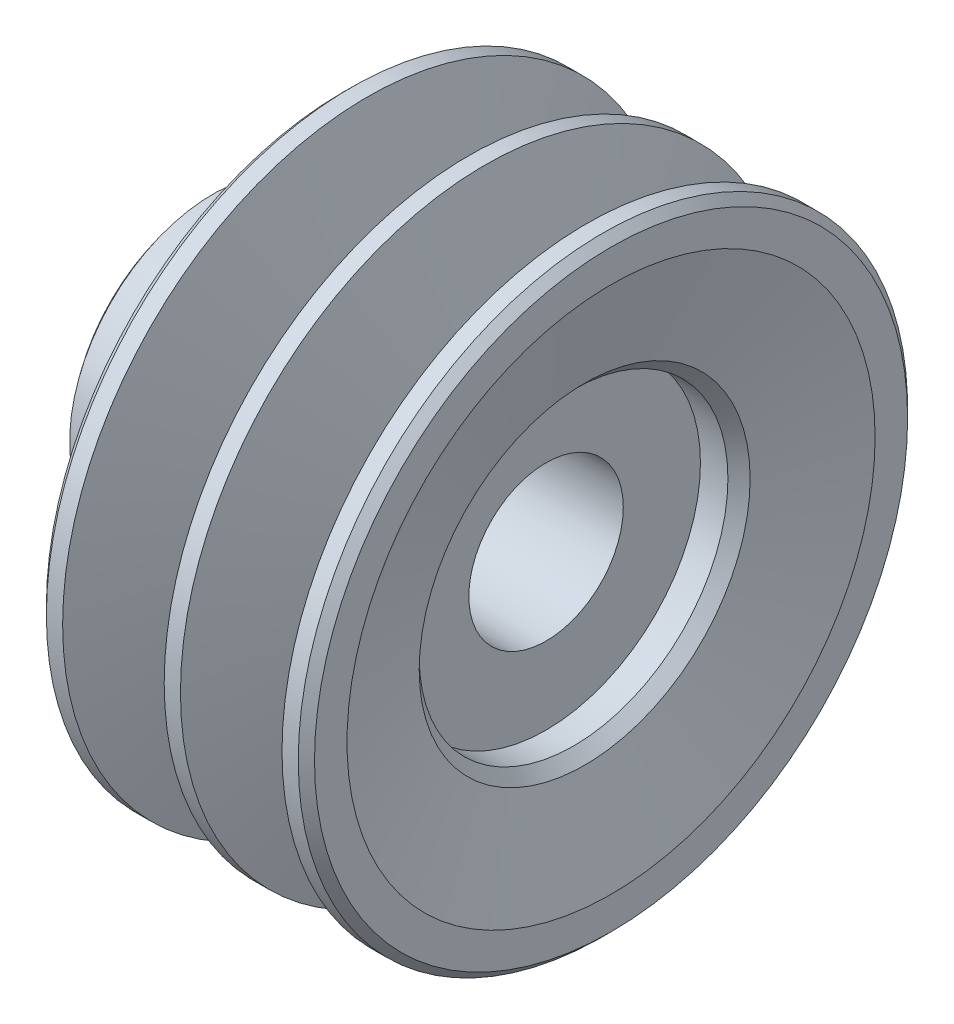
ISO-10303-21;
HEADER;
FILE_DESCRIPTION(('STEP AP214'),'2;1');
FILE_NAME('part.step','',(''),(''),'','','');
FILE_SCHEMA(('AUTOMOTIVE_DESIGN { 1 0 10303 214 1 1 1 1 }'));
ENDSEC;
DATA;
#1=APPLICATION_CONTEXT('core data for automotive mechanical design processes');
#2=APPLICATION_PROTOCOL_DEFINITION('international standard','automotive_design',2000,#1);
#3=PRODUCT_CONTEXT('',#1,'mechanical');
#4=PRODUCT('Part','Part','',(#3));
#5=PRODUCT_RELATED_PRODUCT_CATEGORY('part','',(#4));
#6=PRODUCT_DEFINITION_FORMATION('','',#4);
#7=PRODUCT_DEFINITION_CONTEXT('part definition',#1,'design');
#8=PRODUCT_DEFINITION('design','',#6,#7);
#9=PRODUCT_DEFINITION_SHAPE('','',#8);
#10=(LENGTH_UNIT() NAMED_UNIT(*) SI_UNIT(.MILLI.,.METRE.));
#11=(NAMED_UNIT(*) PLANE_ANGLE_UNIT() SI_UNIT($,.RADIAN.));
#12=(NAMED_UNIT(*) SI_UNIT($,.STERADIAN.) SOLID_ANGLE_UNIT());
#13=UNCERTAINTY_MEASURE_WITH_UNIT(LENGTH_MEASURE(1.E-05),#10,'distance_accuracy_value','');
#14=(GEOMETRIC_REPRESENTATION_CONTEXT(3) GLOBAL_UNCERTAINTY_ASSIGNED_CONTEXT((#13)) GLOBAL_UNIT_ASSIGNED_CONTEXT((#10,
#11,#12)) REPRESENTATION_CONTEXT('',''));
#15=CARTESIAN_POINT('',(0.,0.,0.));
#16=DIRECTION('',(0.,0.,1.));
#17=DIRECTION('',(1.,0.,0.));
#18=AXIS2_PLACEMENT_3D('',#15,#16,#17);
#19=CARTESIAN_POINT('',(18.25,0.,0.));
#20=DIRECTION('',(-1.,0.,0.));
#21=DIRECTION('',(0.,0.,1.));
#22=AXIS2_PLACEMENT_3D('',#19,#20,#21);
#23=CYLINDRICAL_SURFACE('',#22,23.5);
#24=CARTESIAN_POINT('',(18.25,0.,0.));
#25=DIRECTION('',(1.,0.,0.));
#26=DIRECTION('',(0.,0.,-1.));
#27=AXIS2_PLACEMENT_3D('',#24,#25,#26);
#28=CIRCLE('',#27,23.5);
#29=CARTESIAN_POINT('',(18.25,0.,-23.5));
#30=VERTEX_POINT('',#29);
#31=EDGE_CURVE('E125',#30,#30,#28,.F.);
#32=ORIENTED_EDGE('',*,*,#31,.T.);
#33=EDGE_LOOP('',(#32));
#34=FACE_BOUND('',#33,.T.);
#35=CARTESIAN_POINT('',(13.25,0.,0.));
#36=DIRECTION('',(-1.,0.,0.));
#37=DIRECTION('',(0.,0.,1.));
#38=AXIS2_PLACEMENT_3D('',#35,#36,#37);
#39=CIRCLE('',#38,23.5);
#40=CARTESIAN_POINT('',(13.25,0.,23.5));
#41=VERTEX_POINT('',#40);
#42=EDGE_CURVE('E32',#41,#41,#39,.F.);
#43=ORIENTED_EDGE('',*,*,#42,.T.);
#44=EDGE_LOOP('',(#43));
#45=FACE_BOUND('',#44,.T.);
#46=ADVANCED_FACE('F15',(#34,#45),#23,.T.);
#47=CARTESIAN_POINT('',(13.25,0.,0.));
#48=DIRECTION('',(-1.,0.,0.));
#49=DIRECTION('',(0.,-1.,0.));
#50=AXIS2_PLACEMENT_3D('',#47,#48,#49);
#51=CONICAL_SURFACE('',#50,23.5,1.30908282439369);
#52=ORIENTED_EDGE('',*,*,#42,.F.);
#53=EDGE_LOOP('',(#52));
#54=FACE_BOUND('',#53,.T.);
#55=CARTESIAN_POINT('',(9.5,0.,0.));
#56=DIRECTION('',(-1.,0.,0.));
#57=DIRECTION('',(0.,0.,1.));
#58=AXIS2_PLACEMENT_3D('',#55,#56,#57);
#59=CIRCLE('',#58,37.5);
#60=CARTESIAN_POINT('',(9.5,0.,37.5));
#61=VERTEX_POINT('',#60);
#62=EDGE_CURVE('E123',#61,#61,#59,.F.);
#63=ORIENTED_EDGE('',*,*,#62,.T.);
#64=EDGE_LOOP('',(#63));
#65=FACE_BOUND('',#64,.T.);
#66=ADVANCED_FACE('F133',(#54,#65),#51,.T.);
#67=CARTESIAN_POINT('',(18.25,0.,0.));
#68=DIRECTION('',(1.,0.,0.));
#69=DIRECTION('',(0.,0.,-1.));
#70=AXIS2_PLACEMENT_3D('',#67,#68,#69);
#71=CONICAL_SURFACE('',#70,23.5,1.30908282439369);
#72=ORIENTED_EDGE('',*,*,#31,.F.);
#73=EDGE_LOOP('',(#72));
#74=FACE_BOUND('',#73,.T.);
#75=CARTESIAN_POINT('',(22.,0.,0.));
#76=DIRECTION('',(-1.,0.,0.));
#77=DIRECTION('',(0.,0.,1.));
#78=AXIS2_PLACEMENT_3D('',#75,#76,#77);
#79=CIRCLE('',#78,37.5);
#80=CARTESIAN_POINT('',(22.,0.,37.5));
#81=VERTEX_POINT('',#80);
#82=EDGE_CURVE('E120',#81,#81,#79,.T.);
#83=ORIENTED_EDGE('',*,*,#82,.T.);
#84=EDGE_LOOP('',(#83));
#85=FACE_BOUND('',#84,.T.);
#86=ADVANCED_FACE('F136',(#74,#85),#71,.T.);
#87=CARTESIAN_POINT('',(9.5,0.,0.));
#88=DIRECTION('',(-1.,0.,0.));
#89=DIRECTION('',(0.,0.,1.));
#90=AXIS2_PLACEMENT_3D('',#87,#88,#89);
#91=CYLINDRICAL_SURFACE('',#90,37.5);
#92=ORIENTED_EDGE('',*,*,#62,.F.);
#93=EDGE_LOOP('',(#92));
#94=FACE_BOUND('',#93,.T.);
#95=CARTESIAN_POINT('',(7.49999999999995,0.,0.));
#96=DIRECTION('',(1.,0.,0.));
#97=DIRECTION('',(0.,0.,-1.));
#98=AXIS2_PLACEMENT_3D('',#95,#96,#97);
#99=CIRCLE('',#98,37.5);
#100=CARTESIAN_POINT('',(7.5,0.,-37.5));
#101=VERTEX_POINT('',#100);
#102=EDGE_CURVE('E117',#101,#101,#99,.T.);
#103=ORIENTED_EDGE('',*,*,#102,.T.);
#104=EDGE_LOOP('',(#103));
#105=FACE_BOUND('',#104,.T.);
#106=ADVANCED_FACE('F140',(#94,#105),#91,.T.);
#107=CARTESIAN_POINT('',(24.,0.,0.));
#108=DIRECTION('',(-1.,0.,0.));
#109=DIRECTION('',(0.,0.,1.));
#110=AXIS2_PLACEMENT_3D('',#107,#108,#109);
#111=CYLINDRICAL_SURFACE('',#110,37.5);
#112=CARTESIAN_POINT('',(24.,0.,0.));
#113=DIRECTION('',(-1.,0.,0.));
#114=DIRECTION('',(0.,0.,1.));
#115=AXIS2_PLACEMENT_3D('',#112,#113,#114);
#116=CIRCLE('',#115,37.5);
#117=CARTESIAN_POINT('',(24.,0.,37.5));
#118=VERTEX_POINT('',#117);
#119=EDGE_CURVE('E114',#118,#118,#116,.T.);
#120=ORIENTED_EDGE('',*,*,#119,.T.);
#121=EDGE_LOOP('',(#120));
#122=FACE_BOUND('',#121,.T.);
#123=ORIENTED_EDGE('',*,*,#82,.F.);
#124=EDGE_LOOP('',(#123));
#125=FACE_BOUND('',#124,.T.);
#126=ADVANCED_FACE('F143',(#122,#125),#111,.T.);
#127=CARTESIAN_POINT('',(3.75,0.,0.));
#128=DIRECTION('',(1.,0.,0.));
#129=DIRECTION('',(0.,1.,0.));
#130=AXIS2_PLACEMENT_3D('',#127,#128,#129);
#131=CONICAL_SURFACE('',#130,23.5,1.30908282439369);
#132=CARTESIAN_POINT('',(3.75,0.,0.));
#133=DIRECTION('',(-1.,0.,0.));
#134=DIRECTION('',(0.,0.,1.));
#135=AXIS2_PLACEMENT_3D('',#132,#133,#134);
#136=CIRCLE('',#135,23.5);
#137=CARTESIAN_POINT('',(3.75,0.,23.5));
#138=VERTEX_POINT('',#137);
#139=EDGE_CURVE('E109',#138,#138,#136,.F.);
#140=ORIENTED_EDGE('',*,*,#139,.T.);
#141=EDGE_LOOP('',(#140));
#142=FACE_BOUND('',#141,.T.);
#143=ORIENTED_EDGE('',*,*,#102,.F.);
#144=EDGE_LOOP('',(#143));
#145=FACE_BOUND('',#144,.T.);
#146=ADVANCED_FACE('F147',(#142,#145),#131,.T.);
#147=CARTESIAN_POINT('',(25.,0.,0.));
#148=DIRECTION('',(-1.,0.,0.));
#149=DIRECTION('',(0.,0.,1.));
#150=AXIS2_PLACEMENT_3D('',#147,#148,#149);
#151=CONICAL_SURFACE('',#150,36.5,0.785398163397448);
#152=CARTESIAN_POINT('',(25.,0.,0.));
#153=DIRECTION('',(-1.,0.,0.));
#154=DIRECTION('',(0.,0.,1.));
#155=AXIS2_PLACEMENT_3D('',#152,#153,#154);
#156=CIRCLE('',#155,36.5);
#157=CARTESIAN_POINT('',(25.,0.,36.5));
#158=VERTEX_POINT('',#157);
#159=EDGE_CURVE('E19',#158,#158,#156,.T.);
#160=ORIENTED_EDGE('',*,*,#159,.T.);
#161=EDGE_LOOP('',(#160));
#162=FACE_BOUND('',#161,.T.);
#163=ORIENTED_EDGE('',*,*,#119,.F.);
#164=EDGE_LOOP('',(#163));
#165=FACE_BOUND('',#164,.T.);
#166=ADVANCED_FACE('F149',(#162,#165),#151,.T.);
#167=CARTESIAN_POINT('',(3.75,0.,0.));
#168=DIRECTION('',(-1.,0.,0.));
#169=DIRECTION('',(0.,-1.,0.));
#170=AXIS2_PLACEMENT_3D('',#167,#168,#169);
#171=CYLINDRICAL_SURFACE('',#170,23.5);
#172=ORIENTED_EDGE('',*,*,#139,.F.);
#173=EDGE_LOOP('',(#172));
#174=FACE_BOUND('',#173,.T.);
#175=CARTESIAN_POINT('',(-1.24999999999997,0.,0.));
#176=DIRECTION('',(-1.,0.,0.));
#177=DIRECTION('',(0.,0.,1.));
#178=AXIS2_PLACEMENT_3D('',#175,#176,#177);
#179=CIRCLE('',#178,23.5);
#180=CARTESIAN_POINT('',(-1.25,0.,23.5));
#181=VERTEX_POINT('',#180);
#182=EDGE_CURVE('E98',#181,#181,#179,.F.);
#183=ORIENTED_EDGE('',*,*,#182,.T.);
#184=EDGE_LOOP('',(#183));
#185=FACE_BOUND('',#184,.T.);
#186=ADVANCED_FACE('F157',(#174,#185),#171,.T.);
#187=CARTESIAN_POINT('',(25.,-36.938,-36.938));
#188=DIRECTION('',(-1.,0.,0.));
#189=DIRECTION('',(0.,0.,1.));
#190=AXIS2_PLACEMENT_3D('',#187,#188,#189);
#191=PLANE('',#190);
#192=CARTESIAN_POINT('',(25.,0.,0.));
#193=DIRECTION('',(1.,0.,0.));
#194=DIRECTION('',(0.,0.,-1.));
#195=AXIS2_PLACEMENT_3D('',#192,#193,#194);
#196=CIRCLE('',#195,32.5000000000001);
#197=CARTESIAN_POINT('',(25.,0.,-32.5000000000001));
#198=VERTEX_POINT('',#197);
#199=EDGE_CURVE('E95',#198,#198,#196,.T.);
#200=ORIENTED_EDGE('',*,*,#199,.F.);
#201=EDGE_LOOP('',(#200));
#202=FACE_BOUND('',#201,.T.);
#203=ORIENTED_EDGE('',*,*,#159,.F.);
#204=EDGE_LOOP('',(#203));
#205=FACE_BOUND('',#204,.T.);
#206=ADVANCED_FACE('F208',(#202,#205),#191,.F.);
#207=CARTESIAN_POINT('',(-1.25,0.,0.));
#208=DIRECTION('',(-1.,0.,0.));
#209=DIRECTION('',(0.,-1.,0.));
#210=AXIS2_PLACEMENT_3D('',#207,#208,#209);
#211=CONICAL_SURFACE('',#210,23.5,1.30908282439369);
#212=ORIENTED_EDGE('',*,*,#182,.F.);
#213=EDGE_LOOP('',(#212));
#214=FACE_BOUND('',#213,.T.);
#215=CARTESIAN_POINT('',(-5.,0.,0.));
#216=DIRECTION('',(-1.,0.,0.));
#217=DIRECTION('',(0.,0.,1.));
#218=AXIS2_PLACEMENT_3D('',#215,#216,#217);
#219=CIRCLE('',#218,37.5);
#220=CARTESIAN_POINT('',(-5.,0.,37.5));
#221=VERTEX_POINT('',#220);
#222=EDGE_CURVE('E97',#221,#221,#219,.F.);
#223=ORIENTED_EDGE('',*,*,#222,.T.);
#224=EDGE_LOOP('',(#223));
#225=FACE_BOUND('',#224,.T.);
#226=ADVANCED_FACE('F200',(#214,#225),#211,.T.);
#227=CARTESIAN_POINT('',(21.74978223,0.,0.));
#228=DIRECTION('',(1.,0.,0.));
#229=DIRECTION('',(0.,0.,-1.));
#230=AXIS2_PLACEMENT_3D('',#227,#228,#229);
#231=CONICAL_SURFACE('',#230,20.365853659,1.30908282438683);
#232=CARTESIAN_POINT('',(21.74978223,0.,0.));
#233=DIRECTION('',(1.,0.,0.));
#234=DIRECTION('',(0.,0.,-1.));
#235=AXIS2_PLACEMENT_3D('',#232,#233,#234);
#236=CIRCLE('',#235,20.365853659);
#237=CARTESIAN_POINT('',(21.74978223,0.,-20.365853659));
#238=VERTEX_POINT('',#237);
#239=EDGE_CURVE('E102',#238,#238,#236,.T.);
#240=ORIENTED_EDGE('',*,*,#239,.F.);
#241=EDGE_LOOP('',(#240));
#242=FACE_BOUND('',#241,.T.);
#243=ORIENTED_EDGE('',*,*,#199,.T.);
#244=EDGE_LOOP('',(#243));
#245=FACE_BOUND('',#244,.T.);
#246=ADVANCED_FACE('F197',(#242,#245),#231,.F.);
#247=CARTESIAN_POINT('',(-5.,0.,0.));
#248=DIRECTION('',(-1.,0.,0.));
#249=DIRECTION('',(0.,-1.,0.));
#250=AXIS2_PLACEMENT_3D('',#247,#248,#249);
#251=CYLINDRICAL_SURFACE('',#250,37.5);
#252=ORIENTED_EDGE('',*,*,#222,.F.);
#253=EDGE_LOOP('',(#252));
#254=FACE_BOUND('',#253,.T.);
#255=CARTESIAN_POINT('',(-6.9999999999999,0.,0.));
#256=DIRECTION('',(1.,0.,0.));
#257=DIRECTION('',(0.,0.,-1.));
#258=AXIS2_PLACEMENT_3D('',#255,#256,#257);
#259=CIRCLE('',#258,37.5);
#260=CARTESIAN_POINT('',(-7.,0.,-37.5));
#261=VERTEX_POINT('',#260);
#262=EDGE_CURVE('E190',#261,#261,#259,.T.);
#263=ORIENTED_EDGE('',*,*,#262,.T.);
#264=EDGE_LOOP('',(#263));
#265=FACE_BOUND('',#264,.T.);
#266=ADVANCED_FACE('F199',(#254,#265),#251,.T.);
#267=CARTESIAN_POINT('',(20.383928571,0.,0.));
#268=DIRECTION('',(1.,0.,0.));
#269=DIRECTION('',(0.,0.,-1.));
#270=AXIS2_PLACEMENT_3D('',#267,#268,#269);
#271=CONICAL_SURFACE('',#270,19.,0.785398163397452);
#272=CARTESIAN_POINT('',(20.383928571,0.,0.));
#273=DIRECTION('',(-1.,0.,0.));
#274=DIRECTION('',(0.,0.,1.));
#275=AXIS2_PLACEMENT_3D('',#272,#273,#274);
#276=CIRCLE('',#275,19.);
#277=CARTESIAN_POINT('',(20.383928571,0.,19.));
#278=VERTEX_POINT('',#277);
#279=EDGE_CURVE('E94',#278,#278,#276,.F.);
#280=ORIENTED_EDGE('',*,*,#279,.F.);
#281=EDGE_LOOP('',(#280));
#282=FACE_BOUND('',#281,.T.);
#283=ORIENTED_EDGE('',*,*,#239,.T.);
#284=EDGE_LOOP('',(#283));
#285=FACE_BOUND('',#284,.T.);
#286=ADVANCED_FACE('F195',(#282,#285),#271,.F.);
#287=CARTESIAN_POINT('',(-8.,0.,0.));
#288=DIRECTION('',(1.,0.,0.));
#289=DIRECTION('',(0.,0.,-1.));
#290=AXIS2_PLACEMENT_3D('',#287,#288,#289);
#291=CONICAL_SURFACE('',#290,36.5,0.785398163397449);
#292=CARTESIAN_POINT('',(-8.00000000000001,0.,0.));
#293=DIRECTION('',(1.,0.,0.));
#294=DIRECTION('',(0.,0.,-1.));
#295=AXIS2_PLACEMENT_3D('',#292,#293,#294);
#296=CIRCLE('',#295,36.5);
#297=CARTESIAN_POINT('',(-8.00000000000001,0.,-36.5));
#298=VERTEX_POINT('',#297);
#299=EDGE_CURVE('E92',#298,#298,#296,.T.);
#300=ORIENTED_EDGE('',*,*,#299,.T.);
#301=EDGE_LOOP('',(#300));
#302=FACE_BOUND('',#301,.T.);
#303=ORIENTED_EDGE('',*,*,#262,.F.);
#304=EDGE_LOOP('',(#303));
#305=FACE_BOUND('',#304,.T.);
#306=ADVANCED_FACE('F239',(#302,#305),#291,.T.);
#307=CARTESIAN_POINT('',(20.383928571,0.,0.));
#308=DIRECTION('',(-1.,0.,0.));
#309=DIRECTION('',(0.,0.,1.));
#310=AXIS2_PLACEMENT_3D('',#307,#308,#309);
#311=CYLINDRICAL_SURFACE('',#310,19.);
#312=ORIENTED_EDGE('',*,*,#279,.T.);
#313=EDGE_LOOP('',(#312));
#314=FACE_BOUND('',#313,.T.);
#315=CARTESIAN_POINT('',(17.,0.,0.));
#316=DIRECTION('',(-1.,0.,0.));
#317=DIRECTION('',(0.,0.,1.));
#318=AXIS2_PLACEMENT_3D('',#315,#316,#317);
#319=CIRCLE('',#318,19.);
#320=CARTESIAN_POINT('',(17.,0.,19.));
#321=VERTEX_POINT('',#320);
#322=EDGE_CURVE('E89',#321,#321,#319,.T.);
#323=ORIENTED_EDGE('',*,*,#322,.T.);
#324=EDGE_LOOP('',(#323));
#325=FACE_BOUND('',#324,.T.);
#326=ADVANCED_FACE('F228',(#314,#325),#311,.F.);
#327=CARTESIAN_POINT('',(-8.,-36.938,36.938));
#328=DIRECTION('',(1.,0.,0.));
#329=DIRECTION('',(0.,0.,-1.));
#330=AXIS2_PLACEMENT_3D('',#327,#328,#329);
#331=PLANE('',#330);
#332=CARTESIAN_POINT('',(-8.00000000000001,0.,0.));
#333=DIRECTION('',(-1.,0.,0.));
#334=DIRECTION('',(0.,0.,1.));
#335=AXIS2_PLACEMENT_3D('',#332,#333,#334);
#336=CIRCLE('',#335,30.5);
#337=CARTESIAN_POINT('',(-8.00000000000001,0.,30.5));
#338=VERTEX_POINT('',#337);
#339=EDGE_CURVE('E86',#338,#338,#336,.T.);
#340=ORIENTED_EDGE('',*,*,#339,.F.);
#341=EDGE_LOOP('',(#340));
#342=FACE_BOUND('',#341,.T.);
#343=ORIENTED_EDGE('',*,*,#299,.F.);
#344=EDGE_LOOP('',(#343));
#345=FACE_BOUND('',#344,.T.);
#346=ADVANCED_FACE('F226',(#342,#345),#331,.F.);
#347=CARTESIAN_POINT('',(17.,-19.228,-19.228));
#348=DIRECTION('',(-1.,0.,0.));
#349=DIRECTION('',(0.,0.,1.));
#350=AXIS2_PLACEMENT_3D('',#347,#348,#349);
#351=PLANE('',#350);
#352=CARTESIAN_POINT('',(16.9999999999999,0.,0.));
#353=DIRECTION('',(1.,0.,0.));
#354=DIRECTION('',(0.,0.,-1.));
#355=AXIS2_PLACEMENT_3D('',#352,#353,#354);
#356=CIRCLE('',#355,9.50582087);
#357=CARTESIAN_POINT('',(16.9999999999999,0.,-9.50582087));
#358=VERTEX_POINT('',#357);
#359=EDGE_CURVE('E78',#358,#358,#356,.T.);
#360=ORIENTED_EDGE('',*,*,#359,.F.);
#361=EDGE_LOOP('',(#360));
#362=FACE_BOUND('',#361,.T.);
#363=ORIENTED_EDGE('',*,*,#322,.F.);
#364=EDGE_LOOP('',(#363));
#365=FACE_BOUND('',#364,.T.);
#366=ADVANCED_FACE('F67',(#362,#365),#351,.F.);
#367=CARTESIAN_POINT('',(-19.,0.,-18.71136132448));
#368=DIRECTION('',(0.,0.,1.));
#369=DIRECTION('',(0.,-1.,0.));
#370=AXIS2_PLACEMENT_3D('',#367,#368,#369);
#371=CYLINDRICAL_SURFACE('',#370,2.75);
#372=CARTESIAN_POINT('',(-21.7500000000744,-1.26120321111504E-09,-17.9276315793348));
#373=CARTESIAN_POINT('',(-21.749993112066,0.15435491770588,-17.9276296674891));
#374=CARTESIAN_POINT('',(-21.7369529164703,0.308901355131649,-17.9273320143915));
#375=CARTESIAN_POINT('',(-21.6850935160381,0.613818931001221,-17.9263167167623));
#376=CARTESIAN_POINT('',(-21.6462230075588,0.764181138328765,-17.9255982367302));
#377=CARTESIAN_POINT('',(-21.5438052597182,1.05615032183349,-17.9242653745134));
#378=CARTESIAN_POINT('',(-21.480277064817,1.19776395739439,-17.9236509125146));
#379=CARTESIAN_POINT('',(-21.3303747109909,1.4682498256443,-17.9233141593546));
#380=CARTESIAN_POINT('',(-21.24401038809,1.59712751123492,-17.9235914846534));
#381=CARTESIAN_POINT('',(-21.0509118614054,1.8385154962292,-17.9259834324852));
#382=CARTESIAN_POINT('',(-20.9441838932849,1.95103078751348,-17.9280974932837));
#383=CARTESIAN_POINT('',(-20.7134056256205,2.15652796570563,-17.9351269309386));
#384=CARTESIAN_POINT('',(-20.5893547066582,2.24950915383288,-17.9400424079849));
#385=CARTESIAN_POINT('',(-20.3281214006242,2.41292943617572,-17.953476246585));
#386=CARTESIAN_POINT('',(-20.1909977952985,2.48346377698225,-17.9619790190125));
#387=CARTESIAN_POINT('',(-19.9071877945161,2.60059141851168,-17.9831287999222));
#388=CARTESIAN_POINT('',(-19.7605018453079,2.64718583554583,-17.995775615124));
#389=CARTESIAN_POINT('',(-19.4622488270434,2.71517194395572,-18.0253313814504));
#390=CARTESIAN_POINT('',(-19.3106961262882,2.73663187019697,-18.042228641108));
#391=CARTESIAN_POINT('',(-19.0066298906827,2.75420633536719,-18.0800254036489));
#392=CARTESIAN_POINT('',(-18.8541163044477,2.75031950714665,-18.1009251223572));
#393=CARTESIAN_POINT('',(-18.5507618159466,2.71738864043758,-18.1462589911436));
#394=CARTESIAN_POINT('',(-18.3999539605916,2.6880877846024,-18.1707270946188));
#395=CARTESIAN_POINT('',(-18.1056448009286,2.60499873847021,-18.2219432389152));
#396=CARTESIAN_POINT('',(-17.9621445171854,2.5512071382028,-18.2486915968061));
#397=CARTESIAN_POINT('',(-17.6833864511794,2.41935470135748,-18.3036420106172));
#398=CARTESIAN_POINT('',(-17.548353452502,2.34082599847194,-18.3318625096839));
#399=CARTESIAN_POINT('',(-17.2933958899935,2.16200120056604,-18.3875883398625));
#400=CARTESIAN_POINT('',(-17.1734714362948,2.06170494688754,-18.41509366576));
#401=CARTESIAN_POINT('',(-16.9511936931651,1.84108649754816,-18.4678528600756));
#402=CARTESIAN_POINT('',(-16.8489828976354,1.72061596721697,-18.4930877496856));
#403=CARTESIAN_POINT('',(-16.6663311815631,1.46334260419384,-18.5393273147415));
#404=CARTESIAN_POINT('',(-16.5858978968542,1.32653406708463,-18.560330505771));
#405=CARTESIAN_POINT('',(-16.4508564221773,1.04331849770919,-18.5961773795088));
#406=CARTESIAN_POINT('',(-16.3957738713593,0.897151550952141,-18.611133505397));
#407=CARTESIAN_POINT('',(-16.3111603626831,0.597323336340197,-18.6342990108339));
#408=CARTESIAN_POINT('',(-16.2815682998841,0.443680928670598,-18.642524522399));
#409=CARTESIAN_POINT('',(-16.2601373515423,0.240813276871853,-18.6484896206854));
#410=CARTESIAN_POINT('',(-16.2563390461106,0.192741175018882,-18.649547911072));
#411=CARTESIAN_POINT('',(-16.2512692448055,0.0964530745531369,-18.6509615195434));
#412=CARTESIAN_POINT('',(-16.2499977542675,0.0482370756367391,-18.6513168361438));
#413=CARTESIAN_POINT('',(-16.2500070148531,-0.150675111894126,-18.6513125209209));
#414=CARTESIAN_POINT('',(-16.2624420115243,-0.301555875337901,-18.6478321794367));
#415=CARTESIAN_POINT('',(-16.3118110304445,-0.599149531186487,-18.6341506635813));
#416=CARTESIAN_POINT('',(-16.3487974427246,-0.745852809619828,-18.6239351173368));
#417=CARTESIAN_POINT('',(-16.4459588627449,-1.03050250568091,-18.5975495228972));
#418=CARTESIAN_POINT('',(-16.5060910657467,-1.16846454365803,-18.581390468783));
#419=CARTESIAN_POINT('',(-16.647617402931,-1.43220044571885,-18.5442495308546));
#420=CARTESIAN_POINT('',(-16.7290041452423,-1.55797852631307,-18.5232693240376));
#421=CARTESIAN_POINT('',(-16.9125365498665,-1.7966960393864,-18.4773946570594));
#422=CARTESIAN_POINT('',(-17.0150680005709,-1.90932514991086,-18.4524297481535));
#423=CARTESIAN_POINT('',(-17.2370056694825,-2.1159758611981,-18.4004835934393));
#424=CARTESIAN_POINT('',(-17.3564159151148,-2.20999300809715,-18.3735018671274));
#425=CARTESIAN_POINT('',(-17.612756350523,-2.37957157427929,-18.3183118889029));
#426=CARTESIAN_POINT('',(-17.7501009501691,-2.4545033133443,-18.29009098788));
#427=CARTESIAN_POINT('',(-18.0356999666478,-2.58010912658048,-18.2348445302774));
#428=CARTESIAN_POINT('',(-18.1839548399666,-2.63078218510099,-18.2078190237889));
#429=CARTESIAN_POINT('',(-18.4881578768058,-2.70651263434416,-18.1562497411453));
#430=CARTESIAN_POINT('',(-18.6441425753293,-2.73143315873447,-18.1317198434277));
#431=CARTESIAN_POINT('',(-18.95861638203,-2.75420258892538,-18.0864217544272));
#432=CARTESIAN_POINT('',(-19.1171052081698,-2.75205452203149,-18.065653142752));
#433=CARTESIAN_POINT('',(-19.4291076705115,-2.72075638025943,-18.0288759541282));
#434=CARTESIAN_POINT('',(-19.5826598027233,-2.69208101866823,-18.0127902105776));
#435=CARTESIAN_POINT('',(-19.8830644593865,-2.60901814930013,-17.9850682546954));
#436=CARTESIAN_POINT('',(-20.0299175528994,-2.55463282997659,-17.9734316638006));
#437=CARTESIAN_POINT('',(-20.310154141892,-2.42272298846803,-17.9544753975277));
#438=CARTESIAN_POINT('',(-20.4437198370905,-2.34559487325351,-17.9470876920665));
#439=CARTESIAN_POINT('',(-20.6961821707299,-2.17004631950565,-17.9356971161704));
#440=CARTESIAN_POINT('',(-20.8150800747545,-2.07162772000349,-17.9316939535316));
#441=CARTESIAN_POINT('',(-21.0345670889311,-1.85650374365973,-17.9262047062228));
#442=CARTESIAN_POINT('',(-21.135192896585,-1.73983591616121,-17.9247135254888));
#443=CARTESIAN_POINT('',(-21.315629917731,-1.49129024596552,-17.9232765041746));
#444=CARTESIAN_POINT('',(-21.3954316127647,-1.35940548736858,-17.9233313690294));
#445=CARTESIAN_POINT('',(-21.5323097527084,-1.0834137827787,-17.9240925475122));
#446=CARTESIAN_POINT('',(-21.5892538066545,-0.939241335420281,-17.9248025798928));
#447=CARTESIAN_POINT('',(-21.6780681327422,-0.643578876489962,-17.9261523601435));
#448=CARTESIAN_POINT('',(-21.7099876053836,-0.492103848334902,-17.9267922437895));
#449=CARTESIAN_POINT('',(-21.7359946913757,-0.282951186261276,-17.9273308084785));
#450=CARTESIAN_POINT('',(-21.7412426488579,-0.226495875253026,-17.9274423450173));
#451=CARTESIAN_POINT('',(-21.748246569032,-0.113368990054368,-17.9275930815897));
#452=CARTESIAN_POINT('',(-21.7500025301671,-0.0566974157675632,-17.9276322815911));
#453=CARTESIAN_POINT('',(-21.7500000000744,-1.26120321111504E-09,-17.9276315793348));
#454=B_SPLINE_CURVE_WITH_KNOTS('',3,(#372,#373,#374,#375,#376,#377,#378,#379,#380,#381,#382,
#383,#384,#385,#386,#387,#388,#389,#390,#391,#392,#393,#394,#395,#396,#397,#398,#399,#400,#401,
#402,#403,#404,#405,#406,#407,#408,#409,#410,#411,#412,#413,#414,#415,#416,#417,#418,#419,#420,
#421,#422,#423,#424,#425,#426,#427,#428,#429,#430,#431,#432,#433,#434,#435,#436,#437,#438,#439,
#440,#441,#442,#443,#444,#445,#446,#447,#448,#449,#450,#451,#452,#453),.UNSPECIFIED.,.T.,.F.,(4,
2,2,2,2,2,2,2,2,2,2,2,2,2,2,2,2,2,2,2,2,2,2,2,2,2,2,2,2,2,2,2,2,2,2,2,2,2,2,2,4),(0.,
0.462851003051915,0.92662407008063,1.39003965067382,1.85325595218428,2.31633063668069,
2.77942188362345,3.24052109679839,3.70159880710801,4.16142186533716,4.62126972563982,
5.08581936971915,5.55043371518849,6.0244243734483,6.49841848662146,6.97606444429257,
7.45387766239208,7.92234495387845,8.38968610103069,8.53433689563735,8.67898799567437,
9.13082551157823,9.58363031212169,10.0356017091368,10.4874161290726,10.9483485959158,
11.4093912314332,11.8841002375454,12.3588291168059,12.8360682482546,13.3132540065586,
13.7820622216847,14.2508305386422,14.7118678685792,15.1728653908864,15.6329265550558,
16.0931976409067,16.5560974184023,17.018084796326,17.1880984483144,17.3581121760941),.UNSPECIFIED.);
#455=CARTESIAN_POINT('',(-21.7500000000744,-1.26120321111504E-09,-17.9276315793348));
#456=VERTEX_POINT('',#455);
#457=EDGE_CURVE('E44',#456,#456,#454,.T.);
#458=ORIENTED_EDGE('',*,*,#457,.T.);
#459=EDGE_LOOP('',(#458));
#460=FACE_BOUND('',#459,.T.);
#461=CARTESIAN_POINT('',(-16.25,-2.72535521418878E-10,-9.10537934791667));
#462=CARTESIAN_POINT('',(-16.2500082404077,-0.150279357755906,-9.1053738261084));
#463=CARTESIAN_POINT('',(-16.2623756415377,-0.300723758162809,-9.10146916063393));
#464=CARTESIAN_POINT('',(-16.3114442765525,-0.597368625624841,-9.08624051574154));
#465=CARTESIAN_POINT('',(-16.3481884696629,-0.74356112392715,-9.07490343860026));
#466=CARTESIAN_POINT('',(-16.4446443493041,-1.02714779816747,-9.04602058142071));
#467=CARTESIAN_POINT('',(-16.5043065932707,-1.16456017677954,-9.02848817343919));
#468=CARTESIAN_POINT('',(-16.6447249414313,-1.42737056002706,-8.98897555008608));
#469=CARTESIAN_POINT('',(-16.7254774345688,-1.55277061638432,-8.9669960962793));
#470=CARTESIAN_POINT('',(-16.9084193183885,-1.79195053563692,-8.92007750146953));
#471=CARTESIAN_POINT('',(-17.0111453509119,-1.90530702948569,-8.8950727498756));
#472=CARTESIAN_POINT('',(-17.2339657916418,-2.11349996664138,-8.84516100337773));
#473=CARTESIAN_POINT('',(-17.35406449972,-2.20833181125634,-8.8202540342479));
#474=CARTESIAN_POINT('',(-17.612069475839,-2.37922447360482,-8.77250612658286));
#475=CARTESIAN_POINT('',(-17.750361675802,-2.45472464460803,-8.74973694790382));
#476=CARTESIAN_POINT('',(-18.0384695476363,-2.58121942265717,-8.70964347255055));
#477=CARTESIAN_POINT('',(-18.1882825018379,-2.6322197885996,-8.69231789664078));
#478=CARTESIAN_POINT('',(-18.4909451619504,-2.70684181691476,-8.66554839522131));
#479=CARTESIAN_POINT('',(-18.6436033771126,-2.73116615508474,-8.65590411776967));
#480=CARTESIAN_POINT('',(-18.9511156299263,-2.75388145859715,-8.64481888047576));
#481=CARTESIAN_POINT('',(-19.1059690560799,-2.7522795094527,-8.64337567946963));
#482=CARTESIAN_POINT('',(-19.4069468695254,-2.72375497606371,-8.64860326654552));
#483=CARTESIAN_POINT('',(-19.5531738109249,-2.69783961590042,-8.65495437046285));
#484=CARTESIAN_POINT('',(-19.8391479705727,-2.62300994574844,-8.67432586411562));
#485=CARTESIAN_POINT('',(-19.9788946152543,-2.57409360421078,-8.68734684297316));
#486=CARTESIAN_POINT('',(-20.2496134757582,-2.45420173019917,-8.71858979445014));
#487=CARTESIAN_POINT('',(-20.3804843333508,-2.38301115502964,-8.73686232079547));
#488=CARTESIAN_POINT('',(-20.6287427952191,-2.22074297525923,-8.77642459113437));
#489=CARTESIAN_POINT('',(-20.7461279894464,-2.12966182438695,-8.79771487292277));
#490=CARTESIAN_POINT('',(-20.9692136140781,-1.92573879986931,-8.84188828882748));
#491=CARTESIAN_POINT('',(-21.0742272683716,-1.81215092505753,-8.86480086162984));
#492=CARTESIAN_POINT('',(-21.2639484661274,-1.56871158264065,-8.90877923442163));
#493=CARTESIAN_POINT('',(-21.3486470977813,-1.4388530152862,-8.92984422134987));
#494=CARTESIAN_POINT('',(-21.4959841763764,-1.16490395660681,-8.96792559682886));
#495=CARTESIAN_POINT('',(-21.558392941985,-1.02068383341952,-8.98489927817908));
#496=CARTESIAN_POINT('',(-21.6577689121621,-0.723350516718273,-9.01249568604761));
#497=CARTESIAN_POINT('',(-21.6947875558977,-0.570255989261891,-9.02313124752221));
#498=CARTESIAN_POINT('',(-21.7289701704627,-0.346504060163004,-9.03301443675624));
#499=CARTESIAN_POINT('',(-21.7368475123928,-0.277469653440131,-9.03530524414657));
#500=CARTESIAN_POINT('',(-21.7473643174569,-0.138968343552916,-9.03836973408518));
#501=CARTESIAN_POINT('',(-21.7500037677654,-0.06950143932998,-9.03914341291862));
#502=CARTESIAN_POINT('',(-21.7499918197268,0.150896017583119,-9.03913544622666));
#503=CARTESIAN_POINT('',(-21.7375241297193,0.301954825656341,-9.03547120910939));
#504=CARTESIAN_POINT('',(-21.6880443460545,0.599825036554266,-9.02120284773796));
#505=CARTESIAN_POINT('',(-21.6509895570146,0.746628586508759,-9.0105866518606));
#506=CARTESIAN_POINT('',(-21.5536711613588,1.03143410368843,-8.98361750062212));
#507=CARTESIAN_POINT('',(-21.4934539365623,1.16945302213229,-8.96727601570918));
#508=CARTESIAN_POINT('',(-21.351664771146,1.4333963212187,-8.93061983860555));
#509=CARTESIAN_POINT('',(-21.2700965600212,1.5593228088674,-8.91030584047232));
#510=CARTESIAN_POINT('',(-21.0855145538202,1.79904966026146,-8.86732411504993));
#511=CARTESIAN_POINT('',(-20.9820158907854,1.91246847601572,-8.8446102632435));
#512=CARTESIAN_POINT('',(-20.757527593329,2.12062147249248,-8.79980789538199));
#513=CARTESIAN_POINT('',(-20.636534376854,2.21535181728923,-8.77771950850271));
#514=CARTESIAN_POINT('',(-20.3775292699226,2.38523827014445,-8.73633872293457));
#515=CARTESIAN_POINT('',(-20.2392285206448,2.45997096022727,-8.71711014136139));
#516=CARTESIAN_POINT('',(-19.9513408619698,2.58496767055921,-8.68448561828109));
#517=CARTESIAN_POINT('',(-19.801756972465,2.63523821136515,-8.67108812255793));
#518=CARTESIAN_POINT('',(-19.5002861551205,2.70842212429596,-8.65230959293765));
#519=CARTESIAN_POINT('',(-19.3486008769385,2.73210649430623,-8.64670144850733));
#520=CARTESIAN_POINT('',(-19.0433382863697,2.75391061257637,-8.64364151648528));
#521=CARTESIAN_POINT('',(-18.8897614005219,2.7520360223871,-8.64618792248807));
#522=CARTESIAN_POINT('',(-18.59061094495,2.72336472579992,-8.65903503361378));
#523=CARTESIAN_POINT('',(-18.4449429500368,2.69741909975482,-8.66906865478448));
#524=CARTESIAN_POINT('',(-18.1601797776186,2.62276110367333,-8.69552749708223));
#525=CARTESIAN_POINT('',(-18.0210854099613,2.57404593651863,-8.71195350343864));
#526=CARTESIAN_POINT('',(-17.7505767488496,2.45432532126061,-8.7498246118828));
#527=CARTESIAN_POINT('',(-17.6193441413393,2.38293706169361,-8.77135416855805));
#528=CARTESIAN_POINT('',(-17.3704365678211,2.22016839279657,-8.8170494276754));
#529=CARTESIAN_POINT('',(-17.2527642884417,2.12878403211654,-8.84121565066475));
#530=CARTESIAN_POINT('',(-17.0289412911067,1.92390986162423,-8.89085587947743));
#531=CARTESIAN_POINT('',(-16.923512474992,1.80963265766969,-8.91634111642906));
#532=CARTESIAN_POINT('',(-16.7331378060448,1.56458031969754,-8.96491340368709));
#533=CARTESIAN_POINT('',(-16.6482005749714,1.43379827645525,-8.98799944222225));
#534=CARTESIAN_POINT('',(-16.5009989072674,1.15844690279552,-9.02941701341707));
#535=CARTESIAN_POINT('',(-16.4388544485669,1.01380952948583,-9.04772324447412));
#536=CARTESIAN_POINT('',(-16.3401123063238,0.715586951052338,-9.07735790525633));
#537=CARTESIAN_POINT('',(-16.3034609214633,0.562021297880858,-9.0887009969176));
#538=CARTESIAN_POINT('',(-16.2701534328326,0.33923356557116,-9.09906637083704));
#539=CARTESIAN_POINT('',(-16.2626044776787,0.271640152039475,-9.10142737024274));
#540=CARTESIAN_POINT('',(-16.2525258878615,0.13604243648073,-9.10458511126008));
#541=CARTESIAN_POINT('',(-16.2499962692018,0.0680381331442958,-9.10538184788429));
#542=CARTESIAN_POINT('',(-16.25,-2.72535521418878E-10,-9.10537934791667));
#543=B_SPLINE_CURVE_WITH_KNOTS('',3,(#461,#462,#463,#464,#465,#466,#467,#468,#469,#470,#471,
#472,#473,#474,#475,#476,#477,#478,#479,#480,#481,#482,#483,#484,#485,#486,#487,#488,#489,#490,
#491,#492,#493,#494,#495,#496,#497,#498,#499,#500,#501,#502,#503,#504,#505,#506,#507,#508,#509,
#510,#511,#512,#513,#514,#515,#516,#517,#518,#519,#520,#521,#522,#523,#524,#525,#526,#527,#528,
#529,#530,#531,#532,#533,#534,#535,#536,#537,#538,#539,#540,#541,#542),.UNSPECIFIED.,.T.,.F.,(4,
2,2,2,2,2,2,2,2,2,2,2,2,2,2,2,2,2,2,2,2,2,2,2,2,2,2,2,2,2,2,2,2,2,2,2,2,2,2,2,4),(0.,
0.450575544203003,0.901947254608641,1.35235061206156,1.80267690229352,2.26560483917351,
2.72864755097035,3.20389506723906,3.6790308176353,4.14132574490809,4.60349433162885,
5.04732445007918,5.49119377694516,5.93948795237682,6.38786211908821,6.85483736333407,
7.32201708746672,7.79388059736045,8.26478528805317,8.47316618064719,8.6815475834816,
9.13396877233038,9.58717765169825,10.0394836842758,10.4917107627163,10.9552359280769,
11.4188561361199,11.8916303784792,12.3642785304339,12.8228340741979,13.2812880452323,
13.7241260053152,14.1670183800149,14.617826118515,15.0687230199174,15.5391934783888,
16.0098615416964,16.4829727369066,16.9550842773009,17.1590791689552,17.3630747110191),.UNSPECIFIED.);
#544=CARTESIAN_POINT('',(-16.25,-2.72535521418878E-10,-9.10537934791667));
#545=VERTEX_POINT('',#544);
#546=EDGE_CURVE('E73',#545,#545,#543,.T.);
#547=ORIENTED_EDGE('',*,*,#546,.F.);
#548=EDGE_LOOP('',(#547));
#549=FACE_BOUND('',#548,.T.);
#550=ADVANCED_FACE('F62',(#460,#549),#371,.F.);
#551=CARTESIAN_POINT('',(-6.,0.,0.));
#552=DIRECTION('',(-1.,0.,0.));
#553=DIRECTION('',(0.,0.,1.));
#554=AXIS2_PLACEMENT_3D('',#551,#552,#553);
#555=CONICAL_SURFACE('',#554,20.,1.38257482149013);
#556=CARTESIAN_POINT('',(-6.00000000000001,0.,0.));
#557=DIRECTION('',(1.,0.,0.));
#558=DIRECTION('',(0.,0.,-1.));
#559=AXIS2_PLACEMENT_3D('',#556,#557,#558);
#560=CIRCLE('',#559,20.);
#561=CARTESIAN_POINT('',(-6.,0.,-20.));
#562=VERTEX_POINT('',#561);
#563=EDGE_CURVE('E43',#562,#562,#560,.T.);
#564=ORIENTED_EDGE('',*,*,#563,.T.);
#565=EDGE_LOOP('',(#564));
#566=FACE_BOUND('',#565,.T.);
#567=ORIENTED_EDGE('',*,*,#339,.T.);
#568=EDGE_LOOP('',(#567));
#569=FACE_BOUND('',#568,.T.);
#570=ADVANCED_FACE('F58',(#566,#569),#555,.F.);
#571=CARTESIAN_POINT('',(-19.,0.,8.58368395600639));
#572=DIRECTION('',(0.,0.,1.));
#573=DIRECTION('',(0.,-1.,0.));
#574=AXIS2_PLACEMENT_3D('',#571,#572,#573);
#575=CYLINDRICAL_SURFACE('',#574,2.75);
#576=CARTESIAN_POINT('',(-21.75,-3.27794128172012E-09,9.03914090065476));
#577=CARTESIAN_POINT('',(-21.7499918195481,-0.150896020999527,9.03913544617446));
#578=CARTESIAN_POINT('',(-21.7375241293351,-0.301954829220498,9.03547120899701));
#579=CARTESIAN_POINT('',(-21.6880443452126,-0.599825040367184,9.0212028474967));
#580=CARTESIAN_POINT('',(-21.6509895559212,-0.746628590422689,9.01058665155074));
#581=CARTESIAN_POINT('',(-21.5536711597681,-1.03143410763146,8.9836175001881));
#582=CARTESIAN_POINT('',(-21.4934539347453,-1.16945302601054,8.96727601522433));
#583=CARTESIAN_POINT('',(-21.3516647688856,-1.43339632493054,8.93061983803621));
#584=CARTESIAN_POINT('',(-21.2700965575436,-1.55932281247759,8.91030583986929));
#585=CARTESIAN_POINT('',(-21.0855145509227,-1.79904966362247,8.86732411440191));
#586=CARTESIAN_POINT('',(-20.9820158876868,-1.91246847922931,8.84461026258487));
#587=CARTESIAN_POINT('',(-20.7575275898495,-2.12062147537824,8.79980789472772));
#588=CARTESIAN_POINT('',(-20.6365343731947,-2.2153518199946,8.77771950786342));
#589=CARTESIAN_POINT('',(-20.3775292659543,-2.38523827243627,8.73633872235618));
#590=CARTESIAN_POINT('',(-20.2392285165508,-2.45997096228981,8.71711014082875));
#591=CARTESIAN_POINT('',(-19.9513408576647,-2.58496767214368,8.68448561786174));
#592=CARTESIAN_POINT('',(-19.8017569680746,-2.63523821270089,8.67108812220609));
#593=CARTESIAN_POINT('',(-19.5002861506376,-2.70842212512233,8.6523095927344));
#594=CARTESIAN_POINT('',(-19.3486008724483,-2.73210649487724,8.64670144838331));
#595=CARTESIAN_POINT('',(-19.0433382819115,-2.75391061264466,8.64364151651953));
#596=CARTESIAN_POINT('',(-18.8897613961031,-2.75203602220801,8.64618792260138));
#597=CARTESIAN_POINT('',(-18.5906109406259,-2.72336472514928,8.65903503387343));
#598=CARTESIAN_POINT('',(-18.4449429457671,-2.69741909887544,8.66906865511301));
#599=CARTESIAN_POINT('',(-18.1601797734935,-2.6227611023517,8.69552749753379));
#600=CARTESIAN_POINT('',(-18.0210854059266,-2.57404593498344,8.71195350394437));
#601=CARTESIAN_POINT('',(-17.7505767449926,-2.45432531929861,8.74982461248304));
#602=CARTESIAN_POINT('',(-17.6193441375729,-2.38293705951301,8.77135416919951));
#603=CARTESIAN_POINT('',(-17.3704365642698,-2.22016839019174,8.81704942837744));
#604=CARTESIAN_POINT('',(-17.252764285015,-2.12878402930608,8.84121565138615));
#605=CARTESIAN_POINT('',(-17.0289412879727,-1.92390985841535,8.89085588021281));
#606=CARTESIAN_POINT('',(-16.9235124720268,-1.80963265426964,8.91634111715797));
#607=CARTESIAN_POINT('',(-16.7331378034491,-1.56458031593935,8.9649134043771));
#608=CARTESIAN_POINT('',(-16.6482005725763,-1.43379827253006,8.98799944287981));
#609=CARTESIAN_POINT('',(-16.5009989053255,-1.15844689860517,9.0294170139799));
#610=CARTESIAN_POINT('',(-16.4388544468714,-1.01380952520105,9.04772324497588));
#611=CARTESIAN_POINT('',(-16.340112305134,-0.715586946626251,9.07735790562062));
#612=CARTESIAN_POINT('',(-16.3034609205322,-0.562021293408033,9.08870099720572));
#613=CARTESIAN_POINT('',(-16.2701534324521,-0.339233562264755,9.09906637095605));
#614=CARTESIAN_POINT('',(-16.2626044775003,-0.271640149937407,9.10142737029858));
#615=CARTESIAN_POINT('',(-16.2525258879076,-0.136042436803816,9.10458511124567));
#616=CARTESIAN_POINT('',(-16.2499962692701,-0.0680381346881981,9.10538184786279));
#617=CARTESIAN_POINT('',(-16.2500082402566,0.150279354974919,9.10537382615588));
#618=CARTESIAN_POINT('',(-16.2623756412328,0.300723755379611,9.10146916072971));
#619=CARTESIAN_POINT('',(-16.3114442759404,0.597368622867186,9.08624051593042));
#620=CARTESIAN_POINT('',(-16.348188468898,0.743561121197191,9.07490343883376));
#621=CARTESIAN_POINT('',(-16.4446443482397,1.02714779551799,9.046020581735));
#622=CARTESIAN_POINT('',(-16.5043065920597,1.16456017418283,9.0284881737897));
#623=CARTESIAN_POINT('',(-16.6447249399356,1.42737055755796,8.98897555049725));
#624=CARTESIAN_POINT('',(-16.7254774329351,1.55277061399013,8.96699609671493));
#625=CARTESIAN_POINT('',(-16.9084193164829,1.79195053341106,8.92007750194117));
#626=CARTESIAN_POINT('',(-17.0111453488718,1.90530702735446,8.89507275035846));
#627=CARTESIAN_POINT('',(-17.2339657893461,2.11349996472158,8.84516100386612));
#628=CARTESIAN_POINT('',(-17.3540644973031,2.20833180945329,8.82025403473059));
#629=CARTESIAN_POINT('',(-17.6120694732111,2.3792244720716,8.77250612703294));
#630=CARTESIAN_POINT('',(-17.7503616730867,2.45472464322545,8.74973694832689));
#631=CARTESIAN_POINT('',(-18.0384695447723,2.58121942159001,8.70964347290402));
#632=CARTESIAN_POINT('',(-18.1882824989124,2.63221978769719,8.69231789695167));
#633=CARTESIAN_POINT('',(-18.490945158957,2.70684181635294,8.66554839543538));
#634=CARTESIAN_POINT('',(-18.6436033741131,2.73116615469459,8.6559041179309));
#635=CARTESIAN_POINT('',(-18.9511156269461,2.75388145854547,8.64481888053015));
#636=CARTESIAN_POINT('',(-19.1059690531251,2.75227950956786,8.64337567947002));
#637=CARTESIAN_POINT('',(-19.4069468666363,2.72375497649594,8.64860326644561));
#638=CARTESIAN_POINT('',(-19.5531738080751,2.69783961648546,8.65495437031575));
#639=CARTESIAN_POINT('',(-19.8391479678259,2.62300994662791,8.67432586388356));
#640=CARTESIAN_POINT('',(-19.9788946125711,2.5740936052319,8.68734684270333));
#641=CARTESIAN_POINT('',(-20.2496134731987,2.45420173150158,8.71858979411447));
#642=CARTESIAN_POINT('',(-20.3804843308533,2.38301115647551,8.73686232043094));
#643=CARTESIAN_POINT('',(-20.6287427928681,2.22074297698254,8.77642459072619));
#644=CARTESIAN_POINT('',(-20.7461279871798,2.1296618262442,8.7977148724998));
#645=CARTESIAN_POINT('',(-20.9692136120057,1.92573880198718,8.84188828839018));
#646=CARTESIAN_POINT('',(-21.0742272664098,1.81215092730142,8.86480086119366));
#647=CARTESIAN_POINT('',(-21.2639484644076,1.5687115851208,8.90877923400435));
#648=CARTESIAN_POINT('',(-21.348647096193,1.43885301787664,8.9298442209504));
#649=CARTESIAN_POINT('',(-21.4959841750845,1.16490395937542,8.96792559648375));
#650=CARTESIAN_POINT('',(-21.5583929408544,1.0206838362537,8.98489927787002));
#651=CARTESIAN_POINT('',(-21.657768911364,0.723350519652403,9.01249568582104));
#652=CARTESIAN_POINT('',(-21.6947875552701,0.570255992230269,9.02313124734193));
#653=CARTESIAN_POINT('',(-21.72897017024,0.346504062126943,9.0330144366914));
#654=CARTESIAN_POINT('',(-21.7368475123252,0.277469654368206,9.03530524412688));
#655=CARTESIAN_POINT('',(-21.7473643175418,0.138968342396432,9.03836973410992));
#656=CARTESIAN_POINT('',(-21.7500037678475,0.0695014371247998,9.03914341294266));
#657=CARTESIAN_POINT('',(-21.75,-3.27794128172012E-09,9.03914090065476));
#658=B_SPLINE_CURVE_WITH_KNOTS('',3,(#576,#577,#578,#579,#580,#581,#582,#583,#584,#585,#586,
#587,#588,#589,#590,#591,#592,#593,#594,#595,#596,#597,#598,#599,#600,#601,#602,#603,#604,#605,
#606,#607,#608,#609,#610,#611,#612,#613,#614,#615,#616,#617,#618,#619,#620,#621,#622,#623,#624,
#625,#626,#627,#628,#629,#630,#631,#632,#633,#634,#635,#636,#637,#638,#639,#640,#641,#642,#643,
#644,#645,#646,#647,#648,#649,#650,#651,#652,#653,#654,#655,#656,#657),.UNSPECIFIED.,.T.,.F.,(4,
2,2,2,2,2,2,2,2,2,2,2,2,2,2,2,2,2,2,2,2,2,2,2,2,2,2,2,2,2,2,2,2,2,2,2,2,2,2,2,4),(0.,
0.452421189340387,0.905630069192865,1.3579361018795,1.81016318042992,2.27368834587353,
2.73730855399842,3.21008279634508,3.68273094828639,4.14128649194635,4.59974046287747,
5.04257842293529,5.4854707976106,5.93627853620182,6.38717543769486,6.85764589623906,
7.32831395962125,7.8014251547796,8.27353669511051,8.47753158311264,8.68152712152461,
9.1321026656769,9.58347437604229,10.0338777334524,10.484204023639,10.9471319604546,
11.4101746721879,11.8854221884556,12.3605579388515,12.8228528661963,13.2850214529886,
13.7288515714681,14.1727208983628,14.6210150737423,15.069389240402,15.5363644845972,
16.0035442086775,16.475407718594,16.9463124093194,17.1546933050474,17.3630747110159),.UNSPECIFIED.);
#659=CARTESIAN_POINT('',(-21.75,-3.27794128172012E-09,9.03914090065476));
#660=VERTEX_POINT('',#659);
#661=EDGE_CURVE('E81',#660,#660,#658,.T.);
#662=ORIENTED_EDGE('',*,*,#661,.F.);
#663=EDGE_LOOP('',(#662));
#664=FACE_BOUND('',#663,.T.);
#665=CARTESIAN_POINT('',(-16.2500000014418,-5.10059914409249E-09,18.6513157909479));
#666=CARTESIAN_POINT('',(-16.250007017273,0.150675106389511,18.6513125233935));
#667=CARTESIAN_POINT('',(-16.2624420116548,0.301555869886157,18.6478321802445));
#668=CARTESIAN_POINT('',(-16.3118110285057,0.599149525755042,18.6341506632728));
#669=CARTESIAN_POINT('',(-16.3487974409969,0.745852804158441,18.6239351175856));
#670=CARTESIAN_POINT('',(-16.4459588607655,1.03050250028038,18.5975495236548));
#671=CARTESIAN_POINT('',(-16.5060910633132,1.16846453834546,18.5813904694915));
#672=CARTESIAN_POINT('',(-16.6476173998154,1.43220044069072,18.5442495316025));
#673=CARTESIAN_POINT('',(-16.7290041419082,1.55797852147598,18.5232693248717));
#674=CARTESIAN_POINT('',(-16.9125365460601,1.79669603494615,18.4773946580102));
#675=CARTESIAN_POINT('',(-17.0150679965065,1.90932514568041,18.452429749134));
#676=CARTESIAN_POINT('',(-17.237005664927,2.11597585740261,18.4004835944764));
#677=CARTESIAN_POINT('',(-17.3564159103226,2.20999300453067,18.3735018681915));
#678=CARTESIAN_POINT('',(-17.6127563453012,2.37957157123281,18.3183118899938));
#679=CARTESIAN_POINT('',(-17.7501009447576,2.45450331058665,18.2900909889698));
#680=CARTESIAN_POINT('',(-18.0356999609153,2.58010912443712,18.2348445313432));
#681=CARTESIAN_POINT('',(-18.1839548341038,2.63078218328123,18.2078190248319));
#682=CARTESIAN_POINT('',(-18.4881578707599,2.70651263320111,18.1562497421208));
#683=CARTESIAN_POINT('',(-18.6441425692324,2.73143315794041,18.1317198443589));
#684=CARTESIAN_POINT('',(-18.9586163758874,2.75420258883313,18.0864217552591));
#685=CARTESIAN_POINT('',(-19.1171052020324,2.75205452229272,18.0656531435288));
#686=CARTESIAN_POINT('',(-19.4291076644595,2.72075638121477,18.0288759547892));
#687=CARTESIAN_POINT('',(-19.5826597967501,2.69208101996198,18.0127902111782));
#688=CARTESIAN_POINT('',(-19.8830644536296,2.60901815124971,17.9850682551773));
#689=CARTESIAN_POINT('',(-20.0299175472797,2.5546328322434,17.9734316642241));
#690=CARTESIAN_POINT('',(-20.3101541365851,2.42272299133834,17.9544753978439));
#691=CARTESIAN_POINT('',(-20.4437198319591,2.34559487641247,17.9470876923333));
#692=CARTESIAN_POINT('',(-20.6961821659948,2.17004632320731,17.9356971163488));
#693=CARTESIAN_POINT('',(-20.8150800702401,2.07162772395933,17.931693953671));
#694=CARTESIAN_POINT('',(-21.0345670848875,1.85650374809085,17.9262047062974));
#695=CARTESIAN_POINT('',(-21.1351928927928,1.7398359208151,17.9247135255372));
#696=CARTESIAN_POINT('',(-21.3156299144757,1.49129025101948,17.9232765041822));
#697=CARTESIAN_POINT('',(-21.3954316097948,1.35940549259971,17.9233313690222));
#698=CARTESIAN_POINT('',(-21.5323097503401,1.08341378831614,17.9240925474896));
#699=CARTESIAN_POINT('',(-21.5892538046028,0.939241341086712,17.9248025798696));
#700=CARTESIAN_POINT('',(-21.6780681313272,0.643578882360147,17.926152360114));
#701=CARTESIAN_POINT('',(-21.7099876042883,0.492103854279854,17.9267922437544));
#702=CARTESIAN_POINT('',(-21.7359946910405,0.282951190014035,17.9273308084762));
#703=CARTESIAN_POINT('',(-21.7412426487961,0.226495876751331,17.9274423450288));
#704=CARTESIAN_POINT('',(-21.7482465691886,0.113368987025182,17.9275930815801));
#705=CARTESIAN_POINT('',(-21.7500025302687,0.0566974104653344,17.9276322815466));
#706=CARTESIAN_POINT('',(-21.7499931115129,-0.15435492528964,17.9276296673676));
#707=CARTESIAN_POINT('',(-21.7369529155837,-0.308901362686788,17.9273320143428));
#708=CARTESIAN_POINT('',(-21.6850935143775,-0.613818938414,17.9263167167611));
#709=CARTESIAN_POINT('',(-21.6462230054597,-0.764181145628029,17.9255982367035));
#710=CARTESIAN_POINT('',(-21.543805256799,-1.0561503288421,17.9242653744747));
#711=CARTESIAN_POINT('',(-21.4802770615154,-1.19776396422572,17.9236509124894));
#712=CARTESIAN_POINT('',(-21.3303747069491,-1.4682498320637,17.9233141593632));
#713=CARTESIAN_POINT('',(-21.2440103836894,-1.59712751741922,17.9235914846825));
#714=CARTESIAN_POINT('',(-21.050911856337,-1.8385155018822,17.9259834325733));
#715=CARTESIAN_POINT('',(-20.9441838879083,-1.95103079287082,17.9280974934103));
#716=CARTESIAN_POINT('',(-20.7134056196839,-2.15652797042221,17.9351269311566));
#717=CARTESIAN_POINT('',(-20.58935470047,-2.24950915820465,17.9400424082557));
#718=CARTESIAN_POINT('',(-20.3281213940008,-2.41292943982068,17.9534762469728));
#719=CARTESIAN_POINT('',(-20.1909977884916,-2.48346378024588,17.9619790194642));
#720=CARTESIAN_POINT('',(-19.9071877874101,-2.6005914209899,17.9831288005073));
#721=CARTESIAN_POINT('',(-19.7605018380862,-2.64718583761976,17.9957756157786));
#722=CARTESIAN_POINT('',(-19.4622488196519,-2.71517194521394,18.0253313822437));
#723=CARTESIAN_POINT('',(-19.310696118842,-2.73663187104212,18.0422286419707));
#724=CARTESIAN_POINT('',(-19.0066298831989,-2.75420633538487,18.0800254046422));
#725=CARTESIAN_POINT('',(-18.8541162969809,-2.75031950675027,18.1009251234116));
#726=CARTESIAN_POINT('',(-18.5507618085645,-2.71738863921777,18.1462589923089));
#727=CARTESIAN_POINT('',(-18.399953953278,-2.68808778297056,18.1707270958339));
#728=CARTESIAN_POINT('',(-18.1056447938109,-2.60499873602766,18.2219432402115));
#729=CARTESIAN_POINT('',(-17.9621445101954,-2.55120713536051,18.2486915981337));
#730=CARTESIAN_POINT('',(-17.683386444503,-2.41935469772619,18.3036420119847));
#731=CARTESIAN_POINT('',(-17.5483534460132,-2.34082599445066,18.3318625110594));
#732=CARTESIAN_POINT('',(-17.2933958839618,-2.16200119580554,18.3875883412236));
#733=CARTESIAN_POINT('',(-17.1734714305307,-2.06170494178067,18.4150936670988));
#734=CARTESIAN_POINT('',(-16.9511936880201,-1.8410864918227,18.4678528613265));
#735=CARTESIAN_POINT('',(-16.848982892837,-1.72061596122539,18.4930877508714));
#736=CARTESIAN_POINT('',(-16.6663311774908,-1.46334259769079,18.5393273158014));
#737=CARTESIAN_POINT('',(-16.5858978931685,-1.32653406033094,18.5603305067688));
#738=CARTESIAN_POINT('',(-16.4508564192166,-1.04331849054218,18.5961773802758));
#739=CARTESIAN_POINT('',(-16.3957738687352,-0.897151543622529,18.6111335059981));
#740=CARTESIAN_POINT('',(-16.3111603611177,-0.597323328831987,18.6342990113797));
#741=CARTESIAN_POINT('',(-16.2815682990265,-0.443680921150368,18.6425245230582));
#742=CARTESIAN_POINT('',(-16.2601373510007,-0.240813271555067,18.6484896207059));
#743=CARTESIAN_POINT('',(-16.2563390456421,-0.192741171878732,18.6495479108719));
#744=CARTESIAN_POINT('',(-16.2512692451719,-0.0964530757531467,18.650961519772));
#745=CARTESIAN_POINT('',(-16.2499977553963,-0.0482370790002358,18.6513168370216));
#746=CARTESIAN_POINT('',(-16.2500000014418,-5.10059914409249E-09,18.6513157909479));
#747=B_SPLINE_CURVE_WITH_KNOTS('',3,(#665,#666,#667,#668,#669,#670,#671,#672,#673,#674,#675,
#676,#677,#678,#679,#680,#681,#682,#683,#684,#685,#686,#687,#688,#689,#690,#691,#692,#693,#694,
#695,#696,#697,#698,#699,#700,#701,#702,#703,#704,#705,#706,#707,#708,#709,#710,#711,#712,#713,
#714,#715,#716,#717,#718,#719,#720,#721,#722,#723,#724,#725,#726,#727,#728,#729,#730,#731,#732,
#733,#734,#735,#736,#737,#738,#739,#740,#741,#742,#743,#744,#745,#746),.UNSPECIFIED.,.T.,.F.,(4,
2,2,2,2,2,2,2,2,2,2,2,2,2,2,2,2,2,2,2,2,2,2,2,2,2,2,2,2,2,2,2,2,2,2,2,2,2,2,2,4),(0.,
0.451837515862079,0.90464231609947,1.35661371295308,1.80842813292949,2.26936059971932,
2.73040323508832,3.20511224112075,3.67984112033806,4.15708025182117,4.63426601014825,
5.10307422533833,5.57184254236335,6.03287987232993,6.49387739466378,6.95393855881996,
7.414209644661,7.87710942214106,8.33909680005539,8.50911045884061,8.67912419342014,
9.14197519649166,9.605748263502,10.0691638440875,10.5323801456081,10.9954548300998,
11.4585460770307,11.9196452901831,12.3807230004738,12.8405460587151,13.3003939190239,
13.7649435631601,14.2295579087067,14.7035485670685,15.1775426802815,15.6551886378517,
16.1330018560058,16.6014691474907,17.0688102943941,17.2134610824466,17.3581121759664),.UNSPECIFIED.);
#748=CARTESIAN_POINT('',(-16.2500000014418,-5.10059914409249E-09,18.6513157909479));
#749=VERTEX_POINT('',#748);
#750=EDGE_CURVE('E36',#749,#749,#747,.T.);
#751=ORIENTED_EDGE('',*,*,#750,.T.);
#752=EDGE_LOOP('',(#751));
#753=FACE_BOUND('',#752,.T.);
#754=ADVANCED_FACE('F53',(#664,#753),#575,.F.);
#755=CARTESIAN_POINT('',(-25.,0.,0.));
#756=DIRECTION('',(1.,0.,0.));
#757=DIRECTION('',(0.,0.,-1.));
#758=AXIS2_PLACEMENT_3D('',#755,#756,#757);
#759=CONICAL_SURFACE('',#758,9.,0.0120427718327208);
#760=ORIENTED_EDGE('',*,*,#661,.T.);
#761=EDGE_LOOP('',(#760));
#762=FACE_BOUND('',#761,.T.);
#763=ORIENTED_EDGE('',*,*,#359,.T.);
#764=EDGE_LOOP('',(#763));
#765=FACE_BOUND('',#764,.T.);
#766=ORIENTED_EDGE('',*,*,#546,.T.);
#767=EDGE_LOOP('',(#766));
#768=FACE_BOUND('',#767,.T.);
#769=CARTESIAN_POINT('',(-25.,0.,0.));
#770=DIRECTION('',(1.,0.,0.));
#771=DIRECTION('',(0.,0.,-1.));
#772=AXIS2_PLACEMENT_3D('',#769,#770,#771);
#773=CIRCLE('',#772,9.);
#774=CARTESIAN_POINT('',(-25.,0.,-9.));
#775=VERTEX_POINT('',#774);
#776=EDGE_CURVE('E28',#775,#775,#773,.F.);
#777=ORIENTED_EDGE('',*,*,#776,.T.);
#778=EDGE_LOOP('',(#777));
#779=FACE_BOUND('',#778,.T.);
#780=ADVANCED_FACE('F57',(#762,#765,#768,#779),#759,.F.);
#781=CARTESIAN_POINT('',(-24.008545704,0.,0.));
#782=DIRECTION('',(1.,0.,0.));
#783=DIRECTION('',(0.,1.,0.));
#784=AXIS2_PLACEMENT_3D('',#781,#782,#783);
#785=CONICAL_SURFACE('',#784,17.630454513,0.130827396053947);
#786=ORIENTED_EDGE('',*,*,#457,.F.);
#787=EDGE_LOOP('',(#786));
#788=FACE_BOUND('',#787,.T.);
#789=ORIENTED_EDGE('',*,*,#563,.F.);
#790=EDGE_LOOP('',(#789));
#791=FACE_BOUND('',#790,.T.);
#792=ORIENTED_EDGE('',*,*,#750,.F.);
#793=EDGE_LOOP('',(#792));
#794=FACE_BOUND('',#793,.T.);
#795=CARTESIAN_POINT('',(-24.008545704,0.,0.));
#796=DIRECTION('',(1.,0.,0.));
#797=DIRECTION('',(0.,0.,-1.));
#798=AXIS2_PLACEMENT_3D('',#795,#796,#797);
#799=CIRCLE('',#798,17.630454513);
#800=CARTESIAN_POINT('',(-24.008545704,0.,-17.630454513));
#801=VERTEX_POINT('',#800);
#802=EDGE_CURVE('E23',#801,#801,#799,.T.);
#803=ORIENTED_EDGE('',*,*,#802,.T.);
#804=EDGE_LOOP('',(#803));
#805=FACE_BOUND('',#804,.T.);
#806=ADVANCED_FACE('F49',(#788,#791,#794,#805),#785,.T.);
#807=CARTESIAN_POINT('',(-25.,-16.534622236,16.534622236));
#808=DIRECTION('',(1.,0.,0.));
#809=DIRECTION('',(0.,0.,-1.));
#810=AXIS2_PLACEMENT_3D('',#807,#808,#809);
#811=PLANE('',#810);
#812=ORIENTED_EDGE('',*,*,#776,.F.);
#813=EDGE_LOOP('',(#812));
#814=FACE_BOUND('',#813,.T.);
#815=CARTESIAN_POINT('',(-25.,0.,0.));
#816=DIRECTION('',(1.,0.,0.));
#817=DIRECTION('',(0.,0.,-1.));
#818=AXIS2_PLACEMENT_3D('',#815,#816,#817);
#819=CIRCLE('',#818,16.338559521);
#820=CARTESIAN_POINT('',(-25.,0.,-16.338559521));
#821=VERTEX_POINT('',#820);
#822=EDGE_CURVE('E10',#821,#821,#819,.F.);
#823=ORIENTED_EDGE('',*,*,#822,.T.);
#824=EDGE_LOOP('',(#823));
#825=FACE_BOUND('',#824,.T.);
#826=ADVANCED_FACE('F17',(#814,#825),#811,.F.);
#827=CARTESIAN_POINT('',(-25.,0.,0.));
#828=DIRECTION('',(1.,0.,0.));
#829=DIRECTION('',(0.,0.,-1.));
#830=AXIS2_PLACEMENT_3D('',#827,#828,#829);
#831=CONICAL_SURFACE('',#830,16.338559521,0.916225559562137);
#832=ORIENTED_EDGE('',*,*,#822,.F.);
#833=EDGE_LOOP('',(#832));
#834=FACE_BOUND('',#833,.T.);
#835=ORIENTED_EDGE('',*,*,#802,.F.);
#836=EDGE_LOOP('',(#835));
#837=FACE_BOUND('',#836,.T.);
#838=ADVANCED_FACE('F162',(#834,#837),#831,.T.);
#839=CLOSED_SHELL('',(#46,#66,#86,#106,#126,#146,#166,#186,#206,#226,#246,#266,#286,#306,#326,
#346,#366,#550,#570,#754,#780,#806,#826,#838));
#840=MANIFOLD_SOLID_BREP('B1',#839);
#841=ADVANCED_BREP_SHAPE_REPRESENTATION('',(#18,#840),#14);
#842=SHAPE_DEFINITION_REPRESENTATION(#9,#841);
ENDSEC;
END-ISO-10303-21;
